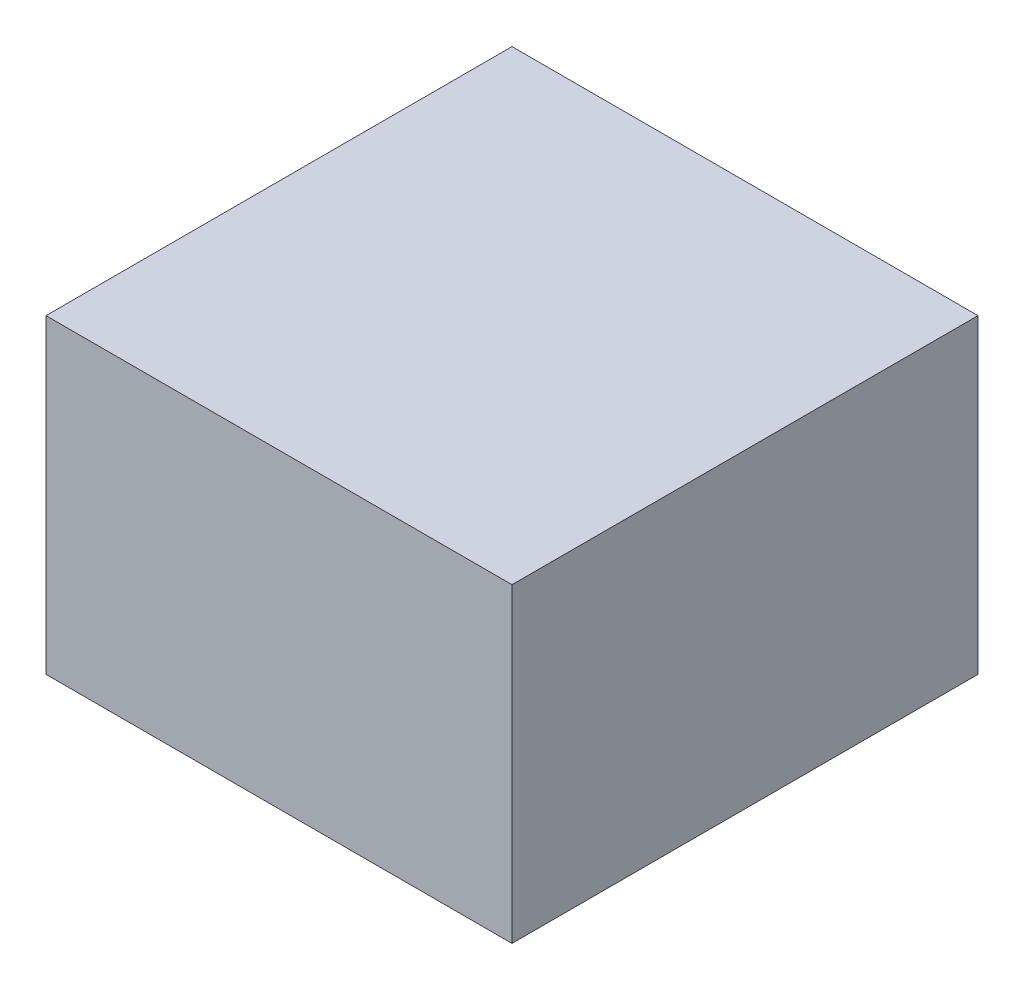
ISO-10303-21;
HEADER;
FILE_DESCRIPTION(('STEP AP214'),'2;1');
FILE_NAME('part.step','',(''),(''),'','','');
FILE_SCHEMA(('AUTOMOTIVE_DESIGN { 1 0 10303 214 1 1 1 1 }'));
ENDSEC;
DATA;
#1=APPLICATION_CONTEXT('core data for automotive mechanical design processes');
#2=APPLICATION_PROTOCOL_DEFINITION('international standard','automotive_design',2000,#1);
#3=PRODUCT_CONTEXT('',#1,'mechanical');
#4=PRODUCT('Part','Part','',(#3));
#5=PRODUCT_RELATED_PRODUCT_CATEGORY('part','',(#4));
#6=PRODUCT_DEFINITION_FORMATION('','',#4);
#7=PRODUCT_DEFINITION_CONTEXT('part definition',#1,'design');
#8=PRODUCT_DEFINITION('design','',#6,#7);
#9=PRODUCT_DEFINITION_SHAPE('','',#8);
#10=(LENGTH_UNIT() NAMED_UNIT(*) SI_UNIT(.MILLI.,.METRE.));
#11=(NAMED_UNIT(*) PLANE_ANGLE_UNIT() SI_UNIT($,.RADIAN.));
#12=(NAMED_UNIT(*) SI_UNIT($,.STERADIAN.) SOLID_ANGLE_UNIT());
#13=UNCERTAINTY_MEASURE_WITH_UNIT(LENGTH_MEASURE(1.E-05),#10,'distance_accuracy_value','');
#14=(GEOMETRIC_REPRESENTATION_CONTEXT(3) GLOBAL_UNCERTAINTY_ASSIGNED_CONTEXT((#13)) GLOBAL_UNIT_ASSIGNED_CONTEXT((#10,
#11,#12)) REPRESENTATION_CONTEXT('',''));
#15=CARTESIAN_POINT('',(0.,0.,0.));
#16=DIRECTION('',(0.,0.,1.));
#17=DIRECTION('',(1.,0.,0.));
#18=AXIS2_PLACEMENT_3D('',#15,#16,#17);
#19=CARTESIAN_POINT('',(25.3957515097362,20.,60.));
#20=DIRECTION('',(-1.,0.,0.));
#21=DIRECTION('',(0.,-1.,0.));
#22=AXIS2_PLACEMENT_3D('',#19,#20,#21);
#23=PLANE('',#22);
#24=DIRECTION('',(0.,1.,0.));
#25=VECTOR('',#24,1.);
#26=CARTESIAN_POINT('',(25.3957515097362,20.,0.));
#27=LINE('',#26,#25);
#28=CARTESIAN_POINT('',(25.3957515097362,-20.,0.));
#29=VERTEX_POINT('',#28);
#30=CARTESIAN_POINT('',(25.3957515097362,20.,0.));
#31=VERTEX_POINT('',#30);
#32=EDGE_CURVE('E95',#29,#31,#27,.T.);
#33=ORIENTED_EDGE('',*,*,#32,.T.);
#34=DIRECTION('',(0.,0.,-1.));
#35=VECTOR('',#34,1.);
#36=CARTESIAN_POINT('',(25.3957515097362,20.,60.));
#37=LINE('',#36,#35);
#38=CARTESIAN_POINT('',(25.3957515097362,20.,60.));
#39=VERTEX_POINT('',#38);
#40=EDGE_CURVE('E11',#39,#31,#37,.T.);
#41=ORIENTED_EDGE('',*,*,#40,.F.);
#42=DIRECTION('',(0.,1.,0.));
#43=VECTOR('',#42,1.);
#44=CARTESIAN_POINT('',(25.3957515097362,20.,60.));
#45=LINE('',#44,#43);
#46=CARTESIAN_POINT('',(25.3957515097362,-20.,60.));
#47=VERTEX_POINT('',#46);
#48=EDGE_CURVE('E83',#47,#39,#45,.T.);
#49=ORIENTED_EDGE('',*,*,#48,.F.);
#50=DIRECTION('',(0.,0.,-1.));
#51=VECTOR('',#50,1.);
#52=CARTESIAN_POINT('',(25.3957515097362,-20.,60.));
#53=LINE('',#52,#51);
#54=EDGE_CURVE('E91',#47,#29,#53,.T.);
#55=ORIENTED_EDGE('',*,*,#54,.T.);
#56=EDGE_LOOP('',(#33,#41,#49,#55));
#57=FACE_BOUND('',#56,.T.);
#58=ADVANCED_FACE('F32',(#57),#23,.F.);
#59=CARTESIAN_POINT('',(25.3957515097362,20.,60.));
#60=DIRECTION('',(0.,-1.,0.));
#61=DIRECTION('',(0.,0.,-1.));
#62=AXIS2_PLACEMENT_3D('',#59,#60,#61);
#63=PLANE('',#62);
#64=DIRECTION('',(-1.,0.,0.));
#65=VECTOR('',#64,1.);
#66=CARTESIAN_POINT('',(25.3957515097362,20.,0.));
#67=LINE('',#66,#65);
#68=CARTESIAN_POINT('',(-34.6042484902638,20.,0.));
#69=VERTEX_POINT('',#68);
#70=EDGE_CURVE('E87',#31,#69,#67,.T.);
#71=ORIENTED_EDGE('',*,*,#70,.T.);
#72=DIRECTION('',(0.,0.,-1.));
#73=VECTOR('',#72,1.);
#74=CARTESIAN_POINT('',(-34.6042484902638,20.,60.));
#75=LINE('',#74,#73);
#76=CARTESIAN_POINT('',(-34.6042484902638,20.,60.));
#77=VERTEX_POINT('',#76);
#78=EDGE_CURVE('E40',#77,#69,#75,.T.);
#79=ORIENTED_EDGE('',*,*,#78,.F.);
#80=DIRECTION('',(-1.,0.,0.));
#81=VECTOR('',#80,1.);
#82=CARTESIAN_POINT('',(25.3957515097362,20.,60.));
#83=LINE('',#82,#81);
#84=EDGE_CURVE('E78',#39,#77,#83,.T.);
#85=ORIENTED_EDGE('',*,*,#84,.F.);
#86=ORIENTED_EDGE('',*,*,#40,.T.);
#87=EDGE_LOOP('',(#71,#79,#85,#86));
#88=FACE_BOUND('',#87,.T.);
#89=ADVANCED_FACE('F86',(#88),#63,.F.);
#90=CARTESIAN_POINT('',(-34.6042484902638,20.,60.));
#91=DIRECTION('',(1.,0.,0.));
#92=DIRECTION('',(0.,0.,-1.));
#93=AXIS2_PLACEMENT_3D('',#90,#91,#92);
#94=PLANE('',#93);
#95=DIRECTION('',(0.,-1.,0.));
#96=VECTOR('',#95,1.);
#97=CARTESIAN_POINT('',(-34.6042484902638,20.,0.));
#98=LINE('',#97,#96);
#99=CARTESIAN_POINT('',(-34.6042484902638,-20.,0.));
#100=VERTEX_POINT('',#99);
#101=EDGE_CURVE('E65',#69,#100,#98,.T.);
#102=ORIENTED_EDGE('',*,*,#101,.T.);
#103=DIRECTION('',(0.,0.,-1.));
#104=VECTOR('',#103,1.);
#105=CARTESIAN_POINT('',(-34.6042484902638,-20.,60.));
#106=LINE('',#105,#104);
#107=CARTESIAN_POINT('',(-34.6042484902638,-20.,60.));
#108=VERTEX_POINT('',#107);
#109=EDGE_CURVE('E88',#108,#100,#106,.T.);
#110=ORIENTED_EDGE('',*,*,#109,.F.);
#111=DIRECTION('',(0.,-1.,0.));
#112=VECTOR('',#111,1.);
#113=CARTESIAN_POINT('',(-34.6042484902638,20.,60.));
#114=LINE('',#113,#112);
#115=EDGE_CURVE('E81',#77,#108,#114,.T.);
#116=ORIENTED_EDGE('',*,*,#115,.F.);
#117=ORIENTED_EDGE('',*,*,#78,.T.);
#118=EDGE_LOOP('',(#102,#110,#116,#117));
#119=FACE_BOUND('',#118,.T.);
#120=ADVANCED_FACE('F89',(#119),#94,.F.);
#121=CARTESIAN_POINT('',(25.3957515097362,-20.,60.));
#122=DIRECTION('',(0.,1.,0.));
#123=DIRECTION('',(0.,0.,1.));
#124=AXIS2_PLACEMENT_3D('',#121,#122,#123);
#125=PLANE('',#124);
#126=DIRECTION('',(1.,0.,0.));
#127=VECTOR('',#126,1.);
#128=CARTESIAN_POINT('',(25.3957515097362,-20.,0.));
#129=LINE('',#128,#127);
#130=EDGE_CURVE('E71',#100,#29,#129,.T.);
#131=ORIENTED_EDGE('',*,*,#130,.T.);
#132=ORIENTED_EDGE('',*,*,#54,.F.);
#133=DIRECTION('',(1.,0.,0.));
#134=VECTOR('',#133,1.);
#135=CARTESIAN_POINT('',(25.3957515097362,-20.,60.));
#136=LINE('',#135,#134);
#137=EDGE_CURVE('E48',#108,#47,#136,.T.);
#138=ORIENTED_EDGE('',*,*,#137,.F.);
#139=ORIENTED_EDGE('',*,*,#109,.T.);
#140=EDGE_LOOP('',(#131,#132,#138,#139));
#141=FACE_BOUND('',#140,.T.);
#142=ADVANCED_FACE('F102',(#141),#125,.F.);
#143=CARTESIAN_POINT('',(0.,0.,60.));
#144=DIRECTION('',(0.,0.,-1.));
#145=DIRECTION('',(-1.,0.,0.));
#146=AXIS2_PLACEMENT_3D('',#143,#144,#145);
#147=PLANE('',#146);
#148=ORIENTED_EDGE('',*,*,#48,.T.);
#149=ORIENTED_EDGE('',*,*,#84,.T.);
#150=ORIENTED_EDGE('',*,*,#115,.T.);
#151=ORIENTED_EDGE('',*,*,#137,.T.);
#152=EDGE_LOOP('',(#148,#149,#150,#151));
#153=FACE_BOUND('',#152,.T.);
#154=ADVANCED_FACE('F79',(#153),#147,.F.);
#155=CARTESIAN_POINT('',(0.,0.,0.));
#156=DIRECTION('',(0.,0.,-1.));
#157=DIRECTION('',(-1.,0.,0.));
#158=AXIS2_PLACEMENT_3D('',#155,#156,#157);
#159=PLANE('',#158);
#160=ORIENTED_EDGE('',*,*,#32,.F.);
#161=ORIENTED_EDGE('',*,*,#130,.F.);
#162=ORIENTED_EDGE('',*,*,#101,.F.);
#163=ORIENTED_EDGE('',*,*,#70,.F.);
#164=EDGE_LOOP('',(#160,#161,#162,#163));
#165=FACE_BOUND('',#164,.T.);
#166=ADVANCED_FACE('F105',(#165),#159,.T.);
#167=CLOSED_SHELL('',(#58,#89,#120,#142,#154,#166));
#168=MANIFOLD_SOLID_BREP('B2',#167);
#169=ADVANCED_BREP_SHAPE_REPRESENTATION('',(#18,#168),#14);
#170=SHAPE_DEFINITION_REPRESENTATION(#9,#169);
ENDSEC;
END-ISO-10303-21;
